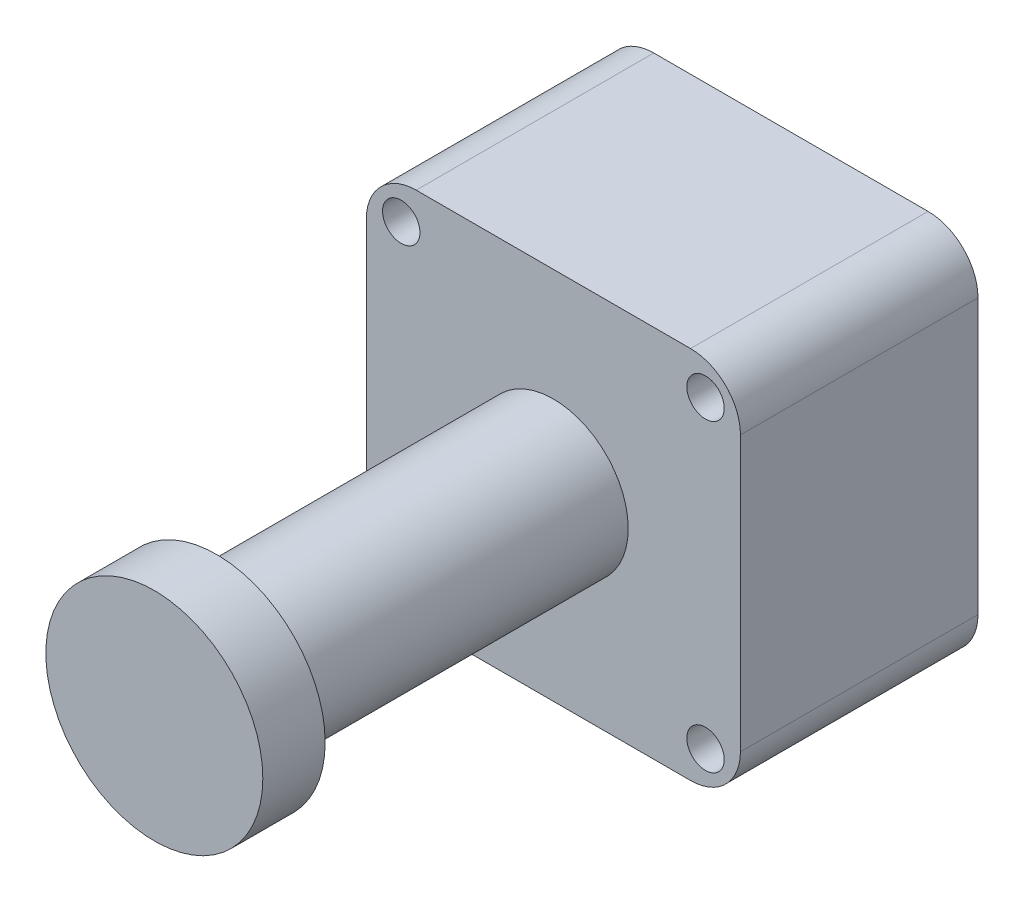
ISO-10303-21;
HEADER;
FILE_DESCRIPTION(('STEP AP214'),'2;1');
FILE_NAME('part.step','',(''),(''),'','','');
FILE_SCHEMA(('AUTOMOTIVE_DESIGN { 1 0 10303 214 1 1 1 1 }'));
ENDSEC;
DATA;
#1=APPLICATION_CONTEXT('core data for automotive mechanical design processes');
#2=APPLICATION_PROTOCOL_DEFINITION('international standard','automotive_design',2000,#1);
#3=PRODUCT_CONTEXT('',#1,'mechanical');
#4=PRODUCT('Part','Part','',(#3));
#5=PRODUCT_RELATED_PRODUCT_CATEGORY('part','',(#4));
#6=PRODUCT_DEFINITION_FORMATION('','',#4);
#7=PRODUCT_DEFINITION_CONTEXT('part definition',#1,'design');
#8=PRODUCT_DEFINITION('design','',#6,#7);
#9=PRODUCT_DEFINITION_SHAPE('','',#8);
#10=(LENGTH_UNIT() NAMED_UNIT(*) SI_UNIT(.MILLI.,.METRE.));
#11=(NAMED_UNIT(*) PLANE_ANGLE_UNIT() SI_UNIT($,.RADIAN.));
#12=(NAMED_UNIT(*) SI_UNIT($,.STERADIAN.) SOLID_ANGLE_UNIT());
#13=UNCERTAINTY_MEASURE_WITH_UNIT(LENGTH_MEASURE(1.E-05),#10,'distance_accuracy_value','');
#14=(GEOMETRIC_REPRESENTATION_CONTEXT(3) GLOBAL_UNCERTAINTY_ASSIGNED_CONTEXT((#13)) GLOBAL_UNIT_ASSIGNED_CONTEXT((#10,
#11,#12)) REPRESENTATION_CONTEXT('',''));
#15=CARTESIAN_POINT('',(0.,0.,0.));
#16=DIRECTION('',(0.,0.,1.));
#17=DIRECTION('',(1.,0.,0.));
#18=AXIS2_PLACEMENT_3D('',#15,#16,#17);
#19=CARTESIAN_POINT('',(15.,-15.,19.05));
#20=DIRECTION('',(-1.,0.,0.));
#21=DIRECTION('',(0.,0.,1.));
#22=AXIS2_PLACEMENT_3D('',#19,#20,#21);
#23=PLANE('',#22);
#24=DIRECTION('',(0.,1.,0.));
#25=VECTOR('',#24,1.);
#26=CARTESIAN_POINT('',(15.,-15.,19.05));
#27=LINE('',#26,#25);
#28=CARTESIAN_POINT('',(15.,-11.,19.05));
#29=VERTEX_POINT('',#28);
#30=CARTESIAN_POINT('',(15.,11.,19.05));
#31=VERTEX_POINT('',#30);
#32=EDGE_CURVE('E125',#29,#31,#27,.T.);
#33=ORIENTED_EDGE('',*,*,#32,.F.);
#34=DIRECTION('',(0.,0.,-1.));
#35=VECTOR('',#34,1.);
#36=CARTESIAN_POINT('',(15.,-11.,19.05));
#37=LINE('',#36,#35);
#38=CARTESIAN_POINT('',(15.,-11.,0.));
#39=VERTEX_POINT('',#38);
#40=EDGE_CURVE('E110',#29,#39,#37,.T.);
#41=ORIENTED_EDGE('',*,*,#40,.T.);
#42=DIRECTION('',(0.,1.,0.));
#43=VECTOR('',#42,1.);
#44=CARTESIAN_POINT('',(15.,-15.,0.));
#45=LINE('',#44,#43);
#46=CARTESIAN_POINT('',(15.,11.,0.));
#47=VERTEX_POINT('',#46);
#48=EDGE_CURVE('E122',#39,#47,#45,.T.);
#49=ORIENTED_EDGE('',*,*,#48,.T.);
#50=DIRECTION('',(0.,0.,-1.));
#51=VECTOR('',#50,1.);
#52=CARTESIAN_POINT('',(15.,11.,19.05));
#53=LINE('',#52,#51);
#54=EDGE_CURVE('E127',#47,#31,#53,.F.);
#55=ORIENTED_EDGE('',*,*,#54,.T.);
#56=EDGE_LOOP('',(#33,#41,#49,#55));
#57=FACE_BOUND('',#56,.T.);
#58=ADVANCED_FACE('F40',(#57),#23,.F.);
#59=CARTESIAN_POINT('',(-15.,15.,19.05));
#60=DIRECTION('',(0.,-1.,0.));
#61=DIRECTION('',(0.,0.,-1.));
#62=AXIS2_PLACEMENT_3D('',#59,#60,#61);
#63=PLANE('',#62);
#64=DIRECTION('',(-1.,0.,0.));
#65=VECTOR('',#64,1.);
#66=CARTESIAN_POINT('',(-15.,15.,0.));
#67=LINE('',#66,#65);
#68=CARTESIAN_POINT('',(11.,15.,0.));
#69=VERTEX_POINT('',#68);
#70=CARTESIAN_POINT('',(-11.,15.,0.));
#71=VERTEX_POINT('',#70);
#72=EDGE_CURVE('E131',#69,#71,#67,.T.);
#73=ORIENTED_EDGE('',*,*,#72,.T.);
#74=DIRECTION('',(0.,0.,-1.));
#75=VECTOR('',#74,1.);
#76=CARTESIAN_POINT('',(-11.,15.,19.05));
#77=LINE('',#76,#75);
#78=CARTESIAN_POINT('',(-11.,15.,19.05));
#79=VERTEX_POINT('',#78);
#80=EDGE_CURVE('E11',#71,#79,#77,.F.);
#81=ORIENTED_EDGE('',*,*,#80,.T.);
#82=DIRECTION('',(-1.,0.,0.));
#83=VECTOR('',#82,1.);
#84=CARTESIAN_POINT('',(-15.,15.,19.05));
#85=LINE('',#84,#83);
#86=CARTESIAN_POINT('',(11.,15.,19.05));
#87=VERTEX_POINT('',#86);
#88=EDGE_CURVE('E171',#87,#79,#85,.T.);
#89=ORIENTED_EDGE('',*,*,#88,.F.);
#90=DIRECTION('',(0.,0.,-1.));
#91=VECTOR('',#90,1.);
#92=CARTESIAN_POINT('',(11.,15.,19.05));
#93=LINE('',#92,#91);
#94=EDGE_CURVE('E48',#87,#69,#93,.T.);
#95=ORIENTED_EDGE('',*,*,#94,.T.);
#96=EDGE_LOOP('',(#73,#81,#89,#95));
#97=FACE_BOUND('',#96,.T.);
#98=ADVANCED_FACE('F169',(#97),#63,.F.);
#99=CARTESIAN_POINT('',(-15.,-15.,19.05));
#100=DIRECTION('',(1.,0.,0.));
#101=DIRECTION('',(0.,0.,-1.));
#102=AXIS2_PLACEMENT_3D('',#99,#100,#101);
#103=PLANE('',#102);
#104=DIRECTION('',(0.,-1.,0.));
#105=VECTOR('',#104,1.);
#106=CARTESIAN_POINT('',(-15.,-15.,0.));
#107=LINE('',#106,#105);
#108=CARTESIAN_POINT('',(-15.,11.,0.));
#109=VERTEX_POINT('',#108);
#110=CARTESIAN_POINT('',(-15.,-11.,0.));
#111=VERTEX_POINT('',#110);
#112=EDGE_CURVE('E135',#109,#111,#107,.T.);
#113=ORIENTED_EDGE('',*,*,#112,.T.);
#114=DIRECTION('',(0.,0.,-1.));
#115=VECTOR('',#114,1.);
#116=CARTESIAN_POINT('',(-15.,-11.,19.05));
#117=LINE('',#116,#115);
#118=CARTESIAN_POINT('',(-15.,-11.,19.05));
#119=VERTEX_POINT('',#118);
#120=EDGE_CURVE('E55',#111,#119,#117,.F.);
#121=ORIENTED_EDGE('',*,*,#120,.T.);
#122=DIRECTION('',(0.,-1.,0.));
#123=VECTOR('',#122,1.);
#124=CARTESIAN_POINT('',(-15.,-15.,19.05));
#125=LINE('',#124,#123);
#126=CARTESIAN_POINT('',(-15.,11.,19.05));
#127=VERTEX_POINT('',#126);
#128=EDGE_CURVE('E179',#127,#119,#125,.T.);
#129=ORIENTED_EDGE('',*,*,#128,.F.);
#130=DIRECTION('',(0.,0.,-1.));
#131=VECTOR('',#130,1.);
#132=CARTESIAN_POINT('',(-15.,11.,19.05));
#133=LINE('',#132,#131);
#134=EDGE_CURVE('E162',#127,#109,#133,.T.);
#135=ORIENTED_EDGE('',*,*,#134,.T.);
#136=EDGE_LOOP('',(#113,#121,#129,#135));
#137=FACE_BOUND('',#136,.T.);
#138=ADVANCED_FACE('F178',(#137),#103,.F.);
#139=CARTESIAN_POINT('',(-15.,-15.,19.05));
#140=DIRECTION('',(0.,1.,0.));
#141=DIRECTION('',(0.,0.,1.));
#142=AXIS2_PLACEMENT_3D('',#139,#140,#141);
#143=PLANE('',#142);
#144=DIRECTION('',(1.,0.,0.));
#145=VECTOR('',#144,1.);
#146=CARTESIAN_POINT('',(-15.,-15.,0.));
#147=LINE('',#146,#145);
#148=CARTESIAN_POINT('',(-11.,-15.,0.));
#149=VERTEX_POINT('',#148);
#150=CARTESIAN_POINT('',(11.,-15.,0.));
#151=VERTEX_POINT('',#150);
#152=EDGE_CURVE('E145',#149,#151,#147,.T.);
#153=ORIENTED_EDGE('',*,*,#152,.T.);
#154=DIRECTION('',(0.,0.,-1.));
#155=VECTOR('',#154,1.);
#156=CARTESIAN_POINT('',(11.,-15.,19.05));
#157=LINE('',#156,#155);
#158=CARTESIAN_POINT('',(11.,-15.,19.05));
#159=VERTEX_POINT('',#158);
#160=EDGE_CURVE('E111',#151,#159,#157,.F.);
#161=ORIENTED_EDGE('',*,*,#160,.T.);
#162=DIRECTION('',(1.,0.,0.));
#163=VECTOR('',#162,1.);
#164=CARTESIAN_POINT('',(-15.,-15.,19.05));
#165=LINE('',#164,#163);
#166=CARTESIAN_POINT('',(-11.,-15.,19.05));
#167=VERTEX_POINT('',#166);
#168=EDGE_CURVE('E141',#167,#159,#165,.T.);
#169=ORIENTED_EDGE('',*,*,#168,.F.);
#170=DIRECTION('',(0.,0.,-1.));
#171=VECTOR('',#170,1.);
#172=CARTESIAN_POINT('',(-11.,-15.,19.05));
#173=LINE('',#172,#171);
#174=EDGE_CURVE('E116',#167,#149,#173,.T.);
#175=ORIENTED_EDGE('',*,*,#174,.T.);
#176=EDGE_LOOP('',(#153,#161,#169,#175));
#177=FACE_BOUND('',#176,.T.);
#178=ADVANCED_FACE('F229',(#177),#143,.F.);
#179=CARTESIAN_POINT('',(0.,0.,19.05));
#180=DIRECTION('',(0.,0.,-1.));
#181=DIRECTION('',(-1.,0.,0.));
#182=AXIS2_PLACEMENT_3D('',#179,#180,#181);
#183=PLANE('',#182);
#184=CARTESIAN_POINT('',(-12.2,-12.2,19.05));
#185=DIRECTION('',(0.,0.,1.));
#186=DIRECTION('',(1.,0.,0.));
#187=AXIS2_PLACEMENT_3D('',#184,#185,#186);
#188=CIRCLE('',#187,1.5);
#189=CARTESIAN_POINT('',(-10.7,-12.2,19.05));
#190=VERTEX_POINT('',#189);
#191=EDGE_CURVE('E188',#190,#190,#188,.T.);
#192=ORIENTED_EDGE('',*,*,#191,.F.);
#193=EDGE_LOOP('',(#192));
#194=FACE_BOUND('',#193,.T.);
#195=CARTESIAN_POINT('',(12.2,-12.2,19.05));
#196=DIRECTION('',(0.,0.,1.));
#197=DIRECTION('',(1.,0.,0.));
#198=AXIS2_PLACEMENT_3D('',#195,#196,#197);
#199=CIRCLE('',#198,1.5);
#200=CARTESIAN_POINT('',(13.7,-12.2,19.05));
#201=VERTEX_POINT('',#200);
#202=EDGE_CURVE('E195',#201,#201,#199,.T.);
#203=ORIENTED_EDGE('',*,*,#202,.F.);
#204=EDGE_LOOP('',(#203));
#205=FACE_BOUND('',#204,.T.);
#206=CARTESIAN_POINT('',(12.2,12.2,19.05));
#207=DIRECTION('',(0.,0.,1.));
#208=DIRECTION('',(1.,0.,0.));
#209=AXIS2_PLACEMENT_3D('',#206,#207,#208);
#210=CIRCLE('',#209,1.5);
#211=CARTESIAN_POINT('',(13.7,12.2,19.05));
#212=VERTEX_POINT('',#211);
#213=EDGE_CURVE('E201',#212,#212,#210,.T.);
#214=ORIENTED_EDGE('',*,*,#213,.F.);
#215=EDGE_LOOP('',(#214));
#216=FACE_BOUND('',#215,.T.);
#217=CARTESIAN_POINT('',(-12.2,12.2,19.05));
#218=DIRECTION('',(0.,0.,1.));
#219=DIRECTION('',(1.,0.,0.));
#220=AXIS2_PLACEMENT_3D('',#217,#218,#219);
#221=CIRCLE('',#220,1.5);
#222=CARTESIAN_POINT('',(-10.7,12.2,19.05));
#223=VERTEX_POINT('',#222);
#224=EDGE_CURVE('E138',#223,#223,#221,.T.);
#225=ORIENTED_EDGE('',*,*,#224,.F.);
#226=EDGE_LOOP('',(#225));
#227=FACE_BOUND('',#226,.T.);
#228=ORIENTED_EDGE('',*,*,#168,.T.);
#229=CARTESIAN_POINT('',(11.,-11.,19.05));
#230=DIRECTION('',(0.,0.,-1.));
#231=DIRECTION('',(-1.,0.,0.));
#232=AXIS2_PLACEMENT_3D('',#229,#230,#231);
#233=CIRCLE('',#232,4.);
#234=EDGE_CURVE('E160',#159,#29,#233,.F.);
#235=ORIENTED_EDGE('',*,*,#234,.T.);
#236=ORIENTED_EDGE('',*,*,#32,.T.);
#237=CARTESIAN_POINT('',(11.,11.,19.05));
#238=DIRECTION('',(0.,0.,-1.));
#239=DIRECTION('',(-1.,0.,0.));
#240=AXIS2_PLACEMENT_3D('',#237,#238,#239);
#241=CIRCLE('',#240,4.);
#242=EDGE_CURVE('E155',#31,#87,#241,.F.);
#243=ORIENTED_EDGE('',*,*,#242,.T.);
#244=ORIENTED_EDGE('',*,*,#88,.T.);
#245=CARTESIAN_POINT('',(-11.,11.,19.05));
#246=DIRECTION('',(0.,0.,-1.));
#247=DIRECTION('',(-1.,0.,0.));
#248=AXIS2_PLACEMENT_3D('',#245,#246,#247);
#249=CIRCLE('',#248,4.);
#250=EDGE_CURVE('E62',#79,#127,#249,.F.);
#251=ORIENTED_EDGE('',*,*,#250,.T.);
#252=ORIENTED_EDGE('',*,*,#128,.T.);
#253=CARTESIAN_POINT('',(-11.,-11.,19.05));
#254=DIRECTION('',(0.,0.,-1.));
#255=DIRECTION('',(-1.,0.,0.));
#256=AXIS2_PLACEMENT_3D('',#253,#254,#255);
#257=CIRCLE('',#256,4.);
#258=EDGE_CURVE('E158',#119,#167,#257,.F.);
#259=ORIENTED_EDGE('',*,*,#258,.T.);
#260=EDGE_LOOP('',(#228,#235,#236,#243,#244,#251,#252,#259));
#261=FACE_BOUND('',#260,.T.);
#262=CARTESIAN_POINT('',(0.,0.,19.05));
#263=DIRECTION('',(0.,0.,1.));
#264=DIRECTION('',(1.,0.,0.));
#265=AXIS2_PLACEMENT_3D('',#262,#263,#264);
#266=CIRCLE('',#265,6.);
#267=CARTESIAN_POINT('',(6.,0.,19.05));
#268=VERTEX_POINT('',#267);
#269=EDGE_CURVE('E212',#268,#268,#266,.T.);
#270=ORIENTED_EDGE('',*,*,#269,.F.);
#271=EDGE_LOOP('',(#270));
#272=FACE_BOUND('',#271,.T.);
#273=ADVANCED_FACE('F227',(#194,#205,#216,#227,#261,#272),#183,.F.);
#274=CARTESIAN_POINT('',(0.,0.,0.));
#275=DIRECTION('',(0.,0.,-1.));
#276=DIRECTION('',(-1.,0.,0.));
#277=AXIS2_PLACEMENT_3D('',#274,#275,#276);
#278=PLANE('',#277);
#279=CARTESIAN_POINT('',(-12.2,-12.2,0.));
#280=DIRECTION('',(0.,0.,1.));
#281=DIRECTION('',(1.,0.,0.));
#282=AXIS2_PLACEMENT_3D('',#279,#280,#281);
#283=CIRCLE('',#282,1.5);
#284=CARTESIAN_POINT('',(-10.7,-12.2,0.));
#285=VERTEX_POINT('',#284);
#286=EDGE_CURVE('E191',#285,#285,#283,.T.);
#287=ORIENTED_EDGE('',*,*,#286,.T.);
#288=EDGE_LOOP('',(#287));
#289=FACE_BOUND('',#288,.T.);
#290=CARTESIAN_POINT('',(12.2,-12.2,0.));
#291=DIRECTION('',(0.,0.,1.));
#292=DIRECTION('',(1.,0.,0.));
#293=AXIS2_PLACEMENT_3D('',#290,#291,#292);
#294=CIRCLE('',#293,1.5);
#295=CARTESIAN_POINT('',(13.7,-12.2,0.));
#296=VERTEX_POINT('',#295);
#297=EDGE_CURVE('E198',#296,#296,#294,.T.);
#298=ORIENTED_EDGE('',*,*,#297,.T.);
#299=EDGE_LOOP('',(#298));
#300=FACE_BOUND('',#299,.T.);
#301=CARTESIAN_POINT('',(12.2,12.2,0.));
#302=DIRECTION('',(0.,0.,1.));
#303=DIRECTION('',(1.,0.,0.));
#304=AXIS2_PLACEMENT_3D('',#301,#302,#303);
#305=CIRCLE('',#304,1.5);
#306=CARTESIAN_POINT('',(13.7,12.2,0.));
#307=VERTEX_POINT('',#306);
#308=EDGE_CURVE('E186',#307,#307,#305,.T.);
#309=ORIENTED_EDGE('',*,*,#308,.T.);
#310=EDGE_LOOP('',(#309));
#311=FACE_BOUND('',#310,.T.);
#312=CARTESIAN_POINT('',(-12.2,12.2,0.));
#313=DIRECTION('',(0.,0.,1.));
#314=DIRECTION('',(1.,0.,0.));
#315=AXIS2_PLACEMENT_3D('',#312,#313,#314);
#316=CIRCLE('',#315,1.5);
#317=CARTESIAN_POINT('',(-10.7,12.2,0.));
#318=VERTEX_POINT('',#317);
#319=EDGE_CURVE('E132',#318,#318,#316,.T.);
#320=ORIENTED_EDGE('',*,*,#319,.T.);
#321=EDGE_LOOP('',(#320));
#322=FACE_BOUND('',#321,.T.);
#323=ORIENTED_EDGE('',*,*,#48,.F.);
#324=CARTESIAN_POINT('',(11.,-11.,0.));
#325=DIRECTION('',(0.,0.,-1.));
#326=DIRECTION('',(-1.,0.,0.));
#327=AXIS2_PLACEMENT_3D('',#324,#325,#326);
#328=CIRCLE('',#327,4.);
#329=EDGE_CURVE('E106',#39,#151,#328,.T.);
#330=ORIENTED_EDGE('',*,*,#329,.T.);
#331=ORIENTED_EDGE('',*,*,#152,.F.);
#332=CARTESIAN_POINT('',(-11.,-11.,0.));
#333=DIRECTION('',(0.,0.,-1.));
#334=DIRECTION('',(-1.,0.,0.));
#335=AXIS2_PLACEMENT_3D('',#332,#333,#334);
#336=CIRCLE('',#335,4.);
#337=EDGE_CURVE('E117',#149,#111,#336,.T.);
#338=ORIENTED_EDGE('',*,*,#337,.T.);
#339=ORIENTED_EDGE('',*,*,#112,.F.);
#340=CARTESIAN_POINT('',(-11.,11.,0.));
#341=DIRECTION('',(0.,0.,-1.));
#342=DIRECTION('',(-1.,0.,0.));
#343=AXIS2_PLACEMENT_3D('',#340,#341,#342);
#344=CIRCLE('',#343,4.);
#345=EDGE_CURVE('E149',#109,#71,#344,.T.);
#346=ORIENTED_EDGE('',*,*,#345,.T.);
#347=ORIENTED_EDGE('',*,*,#72,.F.);
#348=CARTESIAN_POINT('',(11.,11.,0.));
#349=DIRECTION('',(0.,0.,-1.));
#350=DIRECTION('',(-1.,0.,0.));
#351=AXIS2_PLACEMENT_3D('',#348,#349,#350);
#352=CIRCLE('',#351,4.);
#353=EDGE_CURVE('E126',#69,#47,#352,.T.);
#354=ORIENTED_EDGE('',*,*,#353,.T.);
#355=EDGE_LOOP('',(#323,#330,#331,#338,#339,#346,#347,#354));
#356=FACE_BOUND('',#355,.T.);
#357=ADVANCED_FACE('F129',(#289,#300,#311,#322,#356),#278,.T.);
#358=CARTESIAN_POINT('',(11.,-11.,19.05));
#359=DIRECTION('',(0.,0.,-1.));
#360=DIRECTION('',(-1.,0.,0.));
#361=AXIS2_PLACEMENT_3D('',#358,#359,#360);
#362=CYLINDRICAL_SURFACE('',#361,4.);
#363=ORIENTED_EDGE('',*,*,#234,.F.);
#364=ORIENTED_EDGE('',*,*,#160,.F.);
#365=ORIENTED_EDGE('',*,*,#329,.F.);
#366=ORIENTED_EDGE('',*,*,#40,.F.);
#367=EDGE_LOOP('',(#363,#364,#365,#366));
#368=FACE_BOUND('',#367,.T.);
#369=ADVANCED_FACE('F109',(#368),#362,.T.);
#370=CARTESIAN_POINT('',(-11.,-11.,19.05));
#371=DIRECTION('',(0.,0.,-1.));
#372=DIRECTION('',(-1.,0.,0.));
#373=AXIS2_PLACEMENT_3D('',#370,#371,#372);
#374=CYLINDRICAL_SURFACE('',#373,4.);
#375=ORIENTED_EDGE('',*,*,#258,.F.);
#376=ORIENTED_EDGE('',*,*,#120,.F.);
#377=ORIENTED_EDGE('',*,*,#337,.F.);
#378=ORIENTED_EDGE('',*,*,#174,.F.);
#379=EDGE_LOOP('',(#375,#376,#377,#378));
#380=FACE_BOUND('',#379,.T.);
#381=ADVANCED_FACE('F253',(#380),#374,.T.);
#382=CARTESIAN_POINT('',(-11.,11.,19.05));
#383=DIRECTION('',(0.,0.,-1.));
#384=DIRECTION('',(-1.,0.,0.));
#385=AXIS2_PLACEMENT_3D('',#382,#383,#384);
#386=CYLINDRICAL_SURFACE('',#385,4.);
#387=ORIENTED_EDGE('',*,*,#250,.F.);
#388=ORIENTED_EDGE('',*,*,#80,.F.);
#389=ORIENTED_EDGE('',*,*,#345,.F.);
#390=ORIENTED_EDGE('',*,*,#134,.F.);
#391=EDGE_LOOP('',(#387,#388,#389,#390));
#392=FACE_BOUND('',#391,.T.);
#393=ADVANCED_FACE('F177',(#392),#386,.T.);
#394=CARTESIAN_POINT('',(11.,11.,19.05));
#395=DIRECTION('',(0.,0.,-1.));
#396=DIRECTION('',(-1.,0.,0.));
#397=AXIS2_PLACEMENT_3D('',#394,#395,#396);
#398=CYLINDRICAL_SURFACE('',#397,4.);
#399=ORIENTED_EDGE('',*,*,#242,.F.);
#400=ORIENTED_EDGE('',*,*,#54,.F.);
#401=ORIENTED_EDGE('',*,*,#353,.F.);
#402=ORIENTED_EDGE('',*,*,#94,.F.);
#403=EDGE_LOOP('',(#399,#400,#401,#402));
#404=FACE_BOUND('',#403,.T.);
#405=ADVANCED_FACE('F42',(#404),#398,.T.);
#406=CARTESIAN_POINT('',(-12.2,12.2,0.));
#407=DIRECTION('',(0.,0.,1.));
#408=DIRECTION('',(1.,0.,0.));
#409=AXIS2_PLACEMENT_3D('',#406,#407,#408);
#410=CYLINDRICAL_SURFACE('',#409,1.5);
#411=ORIENTED_EDGE('',*,*,#319,.F.);
#412=EDGE_LOOP('',(#411));
#413=FACE_BOUND('',#412,.T.);
#414=ORIENTED_EDGE('',*,*,#224,.T.);
#415=EDGE_LOOP('',(#414));
#416=FACE_BOUND('',#415,.T.);
#417=ADVANCED_FACE('F260',(#413,#416),#410,.F.);
#418=CARTESIAN_POINT('',(12.2,12.2,0.));
#419=DIRECTION('',(0.,0.,1.));
#420=DIRECTION('',(1.,0.,0.));
#421=AXIS2_PLACEMENT_3D('',#418,#419,#420);
#422=CYLINDRICAL_SURFACE('',#421,1.5);
#423=ORIENTED_EDGE('',*,*,#308,.F.);
#424=EDGE_LOOP('',(#423));
#425=FACE_BOUND('',#424,.T.);
#426=ORIENTED_EDGE('',*,*,#213,.T.);
#427=EDGE_LOOP('',(#426));
#428=FACE_BOUND('',#427,.T.);
#429=ADVANCED_FACE('F264',(#425,#428),#422,.F.);
#430=CARTESIAN_POINT('',(12.2,-12.2,0.));
#431=DIRECTION('',(0.,0.,1.));
#432=DIRECTION('',(1.,0.,0.));
#433=AXIS2_PLACEMENT_3D('',#430,#431,#432);
#434=CYLINDRICAL_SURFACE('',#433,1.5);
#435=ORIENTED_EDGE('',*,*,#297,.F.);
#436=EDGE_LOOP('',(#435));
#437=FACE_BOUND('',#436,.T.);
#438=ORIENTED_EDGE('',*,*,#202,.T.);
#439=EDGE_LOOP('',(#438));
#440=FACE_BOUND('',#439,.T.);
#441=ADVANCED_FACE('F271',(#437,#440),#434,.F.);
#442=CARTESIAN_POINT('',(-12.2,-12.2,0.));
#443=DIRECTION('',(0.,0.,1.));
#444=DIRECTION('',(1.,0.,0.));
#445=AXIS2_PLACEMENT_3D('',#442,#443,#444);
#446=CYLINDRICAL_SURFACE('',#445,1.5);
#447=ORIENTED_EDGE('',*,*,#286,.F.);
#448=EDGE_LOOP('',(#447));
#449=FACE_BOUND('',#448,.T.);
#450=ORIENTED_EDGE('',*,*,#191,.T.);
#451=EDGE_LOOP('',(#450));
#452=FACE_BOUND('',#451,.T.);
#453=ADVANCED_FACE('F277',(#449,#452),#446,.F.);
#454=CARTESIAN_POINT('',(0.,0.,46.05));
#455=DIRECTION('',(0.,0.,1.));
#456=DIRECTION('',(1.,0.,0.));
#457=AXIS2_PLACEMENT_3D('',#454,#455,#456);
#458=PLANE('',#457);
#459=CARTESIAN_POINT('',(0.,0.,46.05));
#460=DIRECTION('',(0.,0.,1.));
#461=DIRECTION('',(1.,0.,0.));
#462=AXIS2_PLACEMENT_3D('',#459,#460,#461);
#463=CIRCLE('',#462,8.7);
#464=CARTESIAN_POINT('',(8.7,0.,46.05));
#465=VERTEX_POINT('',#464);
#466=EDGE_CURVE('E208',#465,#465,#463,.T.);
#467=ORIENTED_EDGE('',*,*,#466,.F.);
#468=EDGE_LOOP('',(#467));
#469=FACE_BOUND('',#468,.T.);
#470=CARTESIAN_POINT('',(0.,0.,46.05));
#471=DIRECTION('',(0.,0.,1.));
#472=DIRECTION('',(1.,0.,0.));
#473=AXIS2_PLACEMENT_3D('',#470,#471,#472);
#474=CIRCLE('',#473,6.);
#475=CARTESIAN_POINT('',(6.,0.,46.05));
#476=VERTEX_POINT('',#475);
#477=EDGE_CURVE('E211',#476,#476,#474,.T.);
#478=ORIENTED_EDGE('',*,*,#477,.T.);
#479=EDGE_LOOP('',(#478));
#480=FACE_BOUND('',#479,.T.);
#481=ADVANCED_FACE('F218',(#469,#480),#458,.F.);
#482=CARTESIAN_POINT('',(0.,0.,46.05));
#483=DIRECTION('',(0.,0.,-1.));
#484=DIRECTION('',(-1.,0.,0.));
#485=AXIS2_PLACEMENT_3D('',#482,#483,#484);
#486=CYLINDRICAL_SURFACE('',#485,6.);
#487=ORIENTED_EDGE('',*,*,#477,.F.);
#488=EDGE_LOOP('',(#487));
#489=FACE_BOUND('',#488,.T.);
#490=ORIENTED_EDGE('',*,*,#269,.T.);
#491=EDGE_LOOP('',(#490));
#492=FACE_BOUND('',#491,.T.);
#493=ADVANCED_FACE('F220',(#489,#492),#486,.T.);
#494=CARTESIAN_POINT('',(0.,0.,51.05));
#495=DIRECTION('',(0.,0.,1.));
#496=DIRECTION('',(1.,0.,0.));
#497=AXIS2_PLACEMENT_3D('',#494,#495,#496);
#498=PLANE('',#497);
#499=CARTESIAN_POINT('',(0.,0.,51.05));
#500=DIRECTION('',(0.,0.,1.));
#501=DIRECTION('',(1.,0.,0.));
#502=AXIS2_PLACEMENT_3D('',#499,#500,#501);
#503=CIRCLE('',#502,8.7);
#504=CARTESIAN_POINT('',(8.7,0.,51.05));
#505=VERTEX_POINT('',#504);
#506=EDGE_CURVE('E192',#505,#505,#503,.T.);
#507=ORIENTED_EDGE('',*,*,#506,.T.);
#508=EDGE_LOOP('',(#507));
#509=FACE_BOUND('',#508,.T.);
#510=ADVANCED_FACE('F223',(#509),#498,.T.);
#511=CARTESIAN_POINT('',(0.,0.,51.05));
#512=DIRECTION('',(0.,0.,-1.));
#513=DIRECTION('',(-1.,0.,0.));
#514=AXIS2_PLACEMENT_3D('',#511,#512,#513);
#515=CYLINDRICAL_SURFACE('',#514,8.7);
#516=ORIENTED_EDGE('',*,*,#466,.T.);
#517=EDGE_LOOP('',(#516));
#518=FACE_BOUND('',#517,.T.);
#519=ORIENTED_EDGE('',*,*,#506,.F.);
#520=EDGE_LOOP('',(#519));
#521=FACE_BOUND('',#520,.T.);
#522=ADVANCED_FACE('F284',(#518,#521),#515,.T.);
#523=CLOSED_SHELL('',(#58,#98,#138,#178,#273,#357,#369,#381,#393,#405,#417,#429,#441,#453,#481,
#493,#510,#522));
#524=MANIFOLD_SOLID_BREP('B2',#523);
#525=ADVANCED_BREP_SHAPE_REPRESENTATION('',(#18,#524),#14);
#526=SHAPE_DEFINITION_REPRESENTATION(#9,#525);
ENDSEC;
END-ISO-10303-21;
